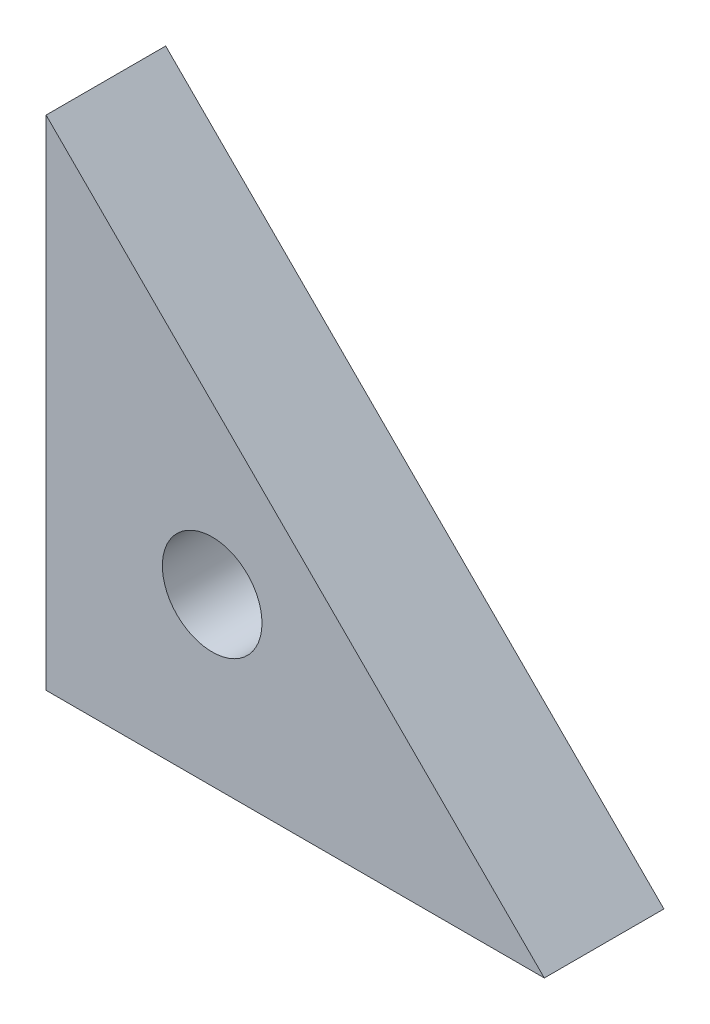
ISO-10303-21;
HEADER;
FILE_DESCRIPTION(('STEP AP214'),'2;1');
FILE_NAME('part.step','',(''),(''),'','','');
FILE_SCHEMA(('AUTOMOTIVE_DESIGN { 1 0 10303 214 1 1 1 1 }'));
ENDSEC;
DATA;
#1=APPLICATION_CONTEXT('core data for automotive mechanical design processes');
#2=APPLICATION_PROTOCOL_DEFINITION('international standard','automotive_design',2000,#1);
#3=PRODUCT_CONTEXT('',#1,'mechanical');
#4=PRODUCT('Part','Part','',(#3));
#5=PRODUCT_RELATED_PRODUCT_CATEGORY('part','',(#4));
#6=PRODUCT_DEFINITION_FORMATION('','',#4);
#7=PRODUCT_DEFINITION_CONTEXT('part definition',#1,'design');
#8=PRODUCT_DEFINITION('design','',#6,#7);
#9=PRODUCT_DEFINITION_SHAPE('','',#8);
#10=(LENGTH_UNIT() NAMED_UNIT(*) SI_UNIT(.MILLI.,.METRE.));
#11=(NAMED_UNIT(*) PLANE_ANGLE_UNIT() SI_UNIT($,.RADIAN.));
#12=(NAMED_UNIT(*) SI_UNIT($,.STERADIAN.) SOLID_ANGLE_UNIT());
#13=UNCERTAINTY_MEASURE_WITH_UNIT(LENGTH_MEASURE(1.E-05),#10,'distance_accuracy_value','');
#14=(GEOMETRIC_REPRESENTATION_CONTEXT(3) GLOBAL_UNCERTAINTY_ASSIGNED_CONTEXT((#13)) GLOBAL_UNIT_ASSIGNED_CONTEXT((#10,
#11,#12)) REPRESENTATION_CONTEXT('',''));
#15=CARTESIAN_POINT('',(0.,0.,0.));
#16=DIRECTION('',(0.,0.,1.));
#17=DIRECTION('',(1.,0.,0.));
#18=AXIS2_PLACEMENT_3D('',#15,#16,#17);
#19=CARTESIAN_POINT('',(25.0000000000001,0.,-6.00000000000012));
#20=DIRECTION('',(0.,-1.,0.));
#21=DIRECTION('',(1.,0.,0.));
#22=AXIS2_PLACEMENT_3D('',#19,#20,#21);
#23=PLANE('',#22);
#24=DIRECTION('',(1.,0.,0.));
#25=VECTOR('',#24,1.);
#26=CARTESIAN_POINT('',(25.,0.,-1.11022302462516E-13));
#27=LINE('',#26,#25);
#28=CARTESIAN_POINT('',(0.,0.,0.));
#29=VERTEX_POINT('',#28);
#30=CARTESIAN_POINT('',(25.,0.,-1.11022302462516E-13));
#31=VERTEX_POINT('',#30);
#32=EDGE_CURVE('E107',#29,#31,#27,.T.);
#33=ORIENTED_EDGE('',*,*,#32,.F.);
#34=DIRECTION('',(0.,0.,0.999999999999999));
#35=VECTOR('',#34,1.);
#36=CARTESIAN_POINT('',(0.,0.,-6.00000000000001));
#37=LINE('',#36,#35);
#38=CARTESIAN_POINT('',(0.,0.,-6.00000000000001));
#39=VERTEX_POINT('',#38);
#40=EDGE_CURVE('E13',#39,#29,#37,.T.);
#41=ORIENTED_EDGE('',*,*,#40,.F.);
#42=DIRECTION('',(1.,0.,0.));
#43=VECTOR('',#42,1.);
#44=CARTESIAN_POINT('',(25.0000000000001,0.,-6.00000000000012));
#45=LINE('',#44,#43);
#46=CARTESIAN_POINT('',(25.0000000000001,0.,-6.00000000000012));
#47=VERTEX_POINT('',#46);
#48=EDGE_CURVE('E96',#39,#47,#45,.T.);
#49=ORIENTED_EDGE('',*,*,#48,.T.);
#50=DIRECTION('',(0.,0.,0.999999999999999));
#51=VECTOR('',#50,1.);
#52=CARTESIAN_POINT('',(25.0000000000001,0.,-6.00000000000012));
#53=LINE('',#52,#51);
#54=EDGE_CURVE('E55',#47,#31,#53,.T.);
#55=ORIENTED_EDGE('',*,*,#54,.T.);
#56=EDGE_LOOP('',(#33,#41,#49,#55));
#57=FACE_BOUND('',#56,.T.);
#58=ADVANCED_FACE('F52',(#57),#23,.T.);
#59=CARTESIAN_POINT('',(0.,0.,-6.00000000000001));
#60=DIRECTION('',(-1.,0.,0.));
#61=DIRECTION('',(0.,0.,0.999999999999999));
#62=AXIS2_PLACEMENT_3D('',#59,#60,#61);
#63=PLANE('',#62);
#64=DIRECTION('',(0.,-1.,0.));
#65=VECTOR('',#64,1.);
#66=CARTESIAN_POINT('',(0.,0.,0.));
#67=LINE('',#66,#65);
#68=CARTESIAN_POINT('',(0.,24.9999999999997,0.));
#69=VERTEX_POINT('',#68);
#70=EDGE_CURVE('E98',#69,#29,#67,.T.);
#71=ORIENTED_EDGE('',*,*,#70,.F.);
#72=DIRECTION('',(0.,0.,0.999999999999999));
#73=VECTOR('',#72,1.);
#74=CARTESIAN_POINT('',(0.,24.9999999999997,-5.99999999999989));
#75=LINE('',#74,#73);
#76=CARTESIAN_POINT('',(0.,24.9999999999997,-5.99999999999989));
#77=VERTEX_POINT('',#76);
#78=EDGE_CURVE('E61',#77,#69,#75,.T.);
#79=ORIENTED_EDGE('',*,*,#78,.F.);
#80=DIRECTION('',(0.,-1.,0.));
#81=VECTOR('',#80,1.);
#82=CARTESIAN_POINT('',(0.,0.,-6.00000000000001));
#83=LINE('',#82,#81);
#84=EDGE_CURVE('E93',#77,#39,#83,.T.);
#85=ORIENTED_EDGE('',*,*,#84,.T.);
#86=ORIENTED_EDGE('',*,*,#40,.T.);
#87=EDGE_LOOP('',(#71,#79,#85,#86));
#88=FACE_BOUND('',#87,.T.);
#89=ADVANCED_FACE('F111',(#88),#63,.T.);
#90=CARTESIAN_POINT('',(0.,24.9999999999997,-5.99999999999989));
#91=DIRECTION('',(0.707106781186544,0.707106781186552,0.));
#92=DIRECTION('',(-0.707106781186552,0.707106781186544,0.));
#93=AXIS2_PLACEMENT_3D('',#90,#91,#92);
#94=PLANE('',#93);
#95=DIRECTION('',(-0.707106781186552,0.707106781186544,0.));
#96=VECTOR('',#95,1.);
#97=CARTESIAN_POINT('',(0.,24.9999999999997,0.));
#98=LINE('',#97,#96);
#99=EDGE_CURVE('E91',#31,#69,#98,.T.);
#100=ORIENTED_EDGE('',*,*,#99,.F.);
#101=ORIENTED_EDGE('',*,*,#54,.F.);
#102=DIRECTION('',(-0.707106781186552,0.707106781186544,0.));
#103=VECTOR('',#102,1.);
#104=CARTESIAN_POINT('',(0.,24.9999999999997,-5.99999999999989));
#105=LINE('',#104,#103);
#106=EDGE_CURVE('E89',#47,#77,#105,.T.);
#107=ORIENTED_EDGE('',*,*,#106,.T.);
#108=ORIENTED_EDGE('',*,*,#78,.T.);
#109=EDGE_LOOP('',(#100,#101,#107,#108));
#110=FACE_BOUND('',#109,.T.);
#111=ADVANCED_FACE('F88',(#110),#94,.T.);
#112=CARTESIAN_POINT('',(0.,0.,-6.00000000000001));
#113=DIRECTION('',(0.,0.,-0.999999999999999));
#114=DIRECTION('',(-1.,0.,0.));
#115=AXIS2_PLACEMENT_3D('',#112,#113,#114);
#116=PLANE('',#115);
#117=CARTESIAN_POINT('',(8.33333333333336,8.3333333333333,-5.99999999999989));
#118=DIRECTION('',(0.,0.,0.999999999999999));
#119=DIRECTION('',(1.,0.,0.));
#120=AXIS2_PLACEMENT_3D('',#117,#118,#119);
#121=CIRCLE('',#120,2.5);
#122=CARTESIAN_POINT('',(10.8333333333334,8.3333333333333,-5.99999999999989));
#123=VERTEX_POINT('',#122);
#124=EDGE_CURVE('E103',#123,#123,#121,.T.);
#125=ORIENTED_EDGE('',*,*,#124,.T.);
#126=EDGE_LOOP('',(#125));
#127=FACE_BOUND('',#126,.T.);
#128=ORIENTED_EDGE('',*,*,#48,.F.);
#129=ORIENTED_EDGE('',*,*,#84,.F.);
#130=ORIENTED_EDGE('',*,*,#106,.F.);
#131=EDGE_LOOP('',(#128,#129,#130));
#132=FACE_BOUND('',#131,.T.);
#133=ADVANCED_FACE('F95',(#127,#132),#116,.T.);
#134=CARTESIAN_POINT('',(0.,0.,0.));
#135=DIRECTION('',(0.,0.,-0.999999999999999));
#136=DIRECTION('',(-1.,0.,0.));
#137=AXIS2_PLACEMENT_3D('',#134,#135,#136);
#138=PLANE('',#137);
#139=CARTESIAN_POINT('',(8.33333333333341,8.33333333333336,1.11022302462516E-13));
#140=DIRECTION('',(0.,0.,0.999999999999999));
#141=DIRECTION('',(1.,0.,0.));
#142=AXIS2_PLACEMENT_3D('',#139,#140,#141);
#143=CIRCLE('',#142,2.5);
#144=CARTESIAN_POINT('',(10.8333333333334,8.33333333333336,1.10954151259583E-13));
#145=VERTEX_POINT('',#144);
#146=EDGE_CURVE('E135',#145,#145,#143,.T.);
#147=ORIENTED_EDGE('',*,*,#146,.F.);
#148=EDGE_LOOP('',(#147));
#149=FACE_BOUND('',#148,.T.);
#150=ORIENTED_EDGE('',*,*,#32,.T.);
#151=ORIENTED_EDGE('',*,*,#99,.T.);
#152=ORIENTED_EDGE('',*,*,#70,.T.);
#153=EDGE_LOOP('',(#150,#151,#152));
#154=FACE_BOUND('',#153,.T.);
#155=ADVANCED_FACE('F110',(#149,#154),#138,.F.);
#156=CARTESIAN_POINT('',(8.33333333333341,8.33333333333336,1.11022302462516E-13));
#157=DIRECTION('',(0.,0.,0.999999999999999));
#158=DIRECTION('',(1.,0.,0.));
#159=AXIS2_PLACEMENT_3D('',#156,#157,#158);
#160=CYLINDRICAL_SURFACE('',#159,2.5);
#161=ORIENTED_EDGE('',*,*,#124,.F.);
#162=EDGE_LOOP('',(#161));
#163=FACE_BOUND('',#162,.T.);
#164=ORIENTED_EDGE('',*,*,#146,.T.);
#165=EDGE_LOOP('',(#164));
#166=FACE_BOUND('',#165,.T.);
#167=ADVANCED_FACE('F121',(#163,#166),#160,.F.);
#168=CLOSED_SHELL('',(#58,#89,#111,#133,#155,#167));
#169=MANIFOLD_SOLID_BREP('B2',#168);
#170=ADVANCED_BREP_SHAPE_REPRESENTATION('',(#18,#169),#14);
#171=SHAPE_DEFINITION_REPRESENTATION(#9,#170);
ENDSEC;
END-ISO-10303-21;
